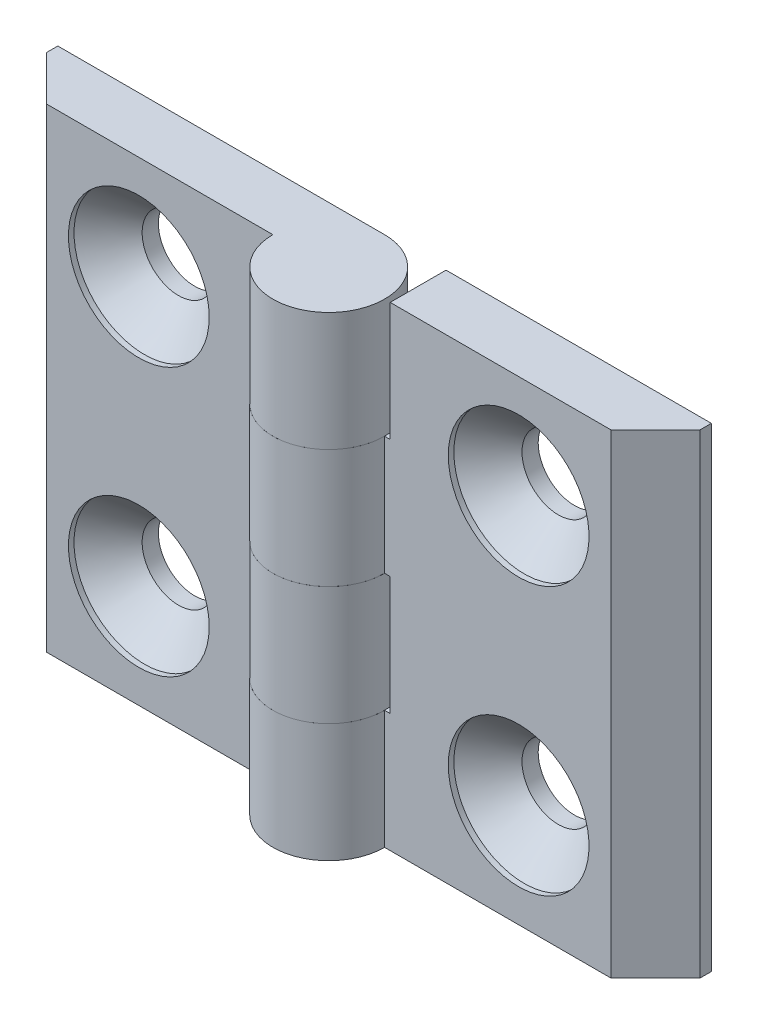
ISO-10303-21;
HEADER;
FILE_DESCRIPTION(('STEP AP214'),'2;1');
FILE_NAME('part.step','',(''),(''),'','','');
FILE_SCHEMA(('AUTOMOTIVE_DESIGN { 1 0 10303 214 1 1 1 1 }'));
ENDSEC;
DATA;
#1=APPLICATION_CONTEXT('core data for automotive mechanical design processes');
#2=APPLICATION_PROTOCOL_DEFINITION('international standard','automotive_design',2000,#1);
#3=PRODUCT_CONTEXT('',#1,'mechanical');
#4=PRODUCT('Part','Part','',(#3));
#5=PRODUCT_RELATED_PRODUCT_CATEGORY('part','',(#4));
#6=PRODUCT_DEFINITION_FORMATION('','',#4);
#7=PRODUCT_DEFINITION_CONTEXT('part definition',#1,'design');
#8=PRODUCT_DEFINITION('design','',#6,#7);
#9=PRODUCT_DEFINITION_SHAPE('','',#8);
#10=(LENGTH_UNIT() NAMED_UNIT(*) SI_UNIT(.MILLI.,.METRE.));
#11=(NAMED_UNIT(*) PLANE_ANGLE_UNIT() SI_UNIT($,.RADIAN.));
#12=(NAMED_UNIT(*) SI_UNIT($,.STERADIAN.) SOLID_ANGLE_UNIT());
#13=UNCERTAINTY_MEASURE_WITH_UNIT(LENGTH_MEASURE(1.E-05),#10,'distance_accuracy_value','');
#14=(GEOMETRIC_REPRESENTATION_CONTEXT(3) GLOBAL_UNCERTAINTY_ASSIGNED_CONTEXT((#13)) GLOBAL_UNIT_ASSIGNED_CONTEXT((#10,
#11,#12)) REPRESENTATION_CONTEXT('',''));
#15=CARTESIAN_POINT('',(0.,0.,0.));
#16=DIRECTION('',(0.,0.,1.));
#17=DIRECTION('',(1.,0.,0.));
#18=AXIS2_PLACEMENT_3D('',#15,#16,#17);
#19=CARTESIAN_POINT('',(0.,-21.25,0.));
#20=DIRECTION('',(0.,1.,0.));
#21=DIRECTION('',(0.,0.,-1.));
#22=AXIS2_PLACEMENT_3D('',#19,#20,#21);
#23=CYLINDRICAL_SURFACE('',#22,5.);
#24=DIRECTION('',(0.,1.,0.));
#25=VECTOR('',#24,1.);
#26=CARTESIAN_POINT('',(5.,-21.25,0.));
#27=LINE('',#26,#25);
#28=CARTESIAN_POINT('',(5.,-21.25,0.));
#29=VERTEX_POINT('',#28);
#30=CARTESIAN_POINT('',(5.,-10.625,0.));
#31=VERTEX_POINT('',#30);
#32=EDGE_CURVE('E194',#29,#31,#27,.T.);
#33=ORIENTED_EDGE('',*,*,#32,.T.);
#34=CARTESIAN_POINT('',(0.,-10.625,0.));
#35=DIRECTION('',(0.,-1.,0.));
#36=DIRECTION('',(0.,0.,1.));
#37=AXIS2_PLACEMENT_3D('',#34,#35,#36);
#38=CIRCLE('',#37,5.);
#39=CARTESIAN_POINT('',(0.,-10.625,-5.));
#40=VERTEX_POINT('',#39);
#41=EDGE_CURVE('E171',#31,#40,#38,.T.);
#42=ORIENTED_EDGE('',*,*,#41,.T.);
#43=DIRECTION('',(0.,1.,0.));
#44=VECTOR('',#43,1.);
#45=CARTESIAN_POINT('',(0.,-21.25,-5.));
#46=LINE('',#45,#44);
#47=CARTESIAN_POINT('',(0.,-21.25,-5.));
#48=VERTEX_POINT('',#47);
#49=EDGE_CURVE('E207',#48,#40,#46,.T.);
#50=ORIENTED_EDGE('',*,*,#49,.F.);
#51=CARTESIAN_POINT('',(0.,-21.25,0.));
#52=DIRECTION('',(0.,-1.,0.));
#53=DIRECTION('',(0.,0.,1.));
#54=AXIS2_PLACEMENT_3D('',#51,#52,#53);
#55=CIRCLE('',#54,5.);
#56=EDGE_CURVE('E174',#29,#48,#55,.T.);
#57=ORIENTED_EDGE('',*,*,#56,.F.);
#58=EDGE_LOOP('',(#33,#42,#50,#57));
#59=FACE_BOUND('',#58,.T.);
#60=ADVANCED_FACE('F45',(#59),#23,.T.);
#61=CARTESIAN_POINT('',(0.,0.,-5.));
#62=VERTEX_POINT('',#61);
#63=CARTESIAN_POINT('',(0.,10.625,-5.));
#64=VERTEX_POINT('',#63);
#65=EDGE_CURVE('E206',#62,#64,#46,.T.);
#66=ORIENTED_EDGE('',*,*,#65,.F.);
#67=CARTESIAN_POINT('',(0.,0.,0.));
#68=DIRECTION('',(0.,1.,0.));
#69=DIRECTION('',(0.,0.,-1.));
#70=AXIS2_PLACEMENT_3D('',#67,#68,#69);
#71=CIRCLE('',#70,5.);
#72=CARTESIAN_POINT('',(5.,0.,0.));
#73=VERTEX_POINT('',#72);
#74=EDGE_CURVE('E142',#62,#73,#71,.T.);
#75=ORIENTED_EDGE('',*,*,#74,.T.);
#76=CARTESIAN_POINT('',(5.,10.625,0.));
#77=VERTEX_POINT('',#76);
#78=EDGE_CURVE('E186',#73,#77,#27,.T.);
#79=ORIENTED_EDGE('',*,*,#78,.T.);
#80=CARTESIAN_POINT('',(0.,10.625,0.));
#81=DIRECTION('',(0.,-1.,0.));
#82=DIRECTION('',(1.,0.,0.));
#83=AXIS2_PLACEMENT_3D('',#80,#81,#82);
#84=CIRCLE('',#83,5.);
#85=EDGE_CURVE('E168',#77,#64,#84,.T.);
#86=ORIENTED_EDGE('',*,*,#85,.T.);
#87=EDGE_LOOP('',(#66,#75,#79,#86));
#88=FACE_BOUND('',#87,.T.);
#89=ADVANCED_FACE('F47',(#88),#23,.T.);
#90=CARTESIAN_POINT('',(0.,-21.25,-5.));
#91=DIRECTION('',(0.,0.,1.));
#92=DIRECTION('',(-1.,0.,0.));
#93=AXIS2_PLACEMENT_3D('',#90,#91,#92);
#94=PLANE('',#93);
#95=CARTESIAN_POINT('',(17.,-12.,-5.00000000000013));
#96=DIRECTION('',(0.,0.,1.));
#97=DIRECTION('',(-1.,0.,0.));
#98=AXIS2_PLACEMENT_3D('',#95,#96,#97);
#99=CIRCLE('',#98,3.25);
#100=CARTESIAN_POINT('',(13.75,-12.,-5.0000000000001));
#101=VERTEX_POINT('',#100);
#102=EDGE_CURVE('E377',#101,#101,#99,.T.);
#103=ORIENTED_EDGE('',*,*,#102,.T.);
#104=EDGE_LOOP('',(#103));
#105=FACE_BOUND('',#104,.T.);
#106=CARTESIAN_POINT('',(17.,12.,-5.00000000000013));
#107=DIRECTION('',(0.,0.,1.));
#108=DIRECTION('',(-1.,0.,0.));
#109=AXIS2_PLACEMENT_3D('',#106,#107,#108);
#110=CIRCLE('',#109,3.25);
#111=CARTESIAN_POINT('',(13.75,12.,-5.0000000000001));
#112=VERTEX_POINT('',#111);
#113=EDGE_CURVE('E155',#112,#112,#110,.T.);
#114=ORIENTED_EDGE('',*,*,#113,.T.);
#115=EDGE_LOOP('',(#114));
#116=FACE_BOUND('',#115,.T.);
#117=ORIENTED_EDGE('',*,*,#49,.T.);
#118=DIRECTION('',(1.,0.,0.));
#119=VECTOR('',#118,1.);
#120=CARTESIAN_POINT('',(5.49999999999996,-10.625,-5.00000000000004));
#121=LINE('',#120,#119);
#122=CARTESIAN_POINT('',(5.49999999999996,-10.625,-5.00000000000004));
#123=VERTEX_POINT('',#122);
#124=EDGE_CURVE('E137',#40,#123,#121,.T.);
#125=ORIENTED_EDGE('',*,*,#124,.T.);
#126=DIRECTION('',(0.,1.,0.));
#127=VECTOR('',#126,1.);
#128=CARTESIAN_POINT('',(5.49999999999996,-10.625,-5.00000000000004));
#129=LINE('',#128,#127);
#130=CARTESIAN_POINT('',(5.49999999999996,0.,-5.00000000000004));
#131=VERTEX_POINT('',#130);
#132=EDGE_CURVE('E132',#123,#131,#129,.T.);
#133=ORIENTED_EDGE('',*,*,#132,.T.);
#134=DIRECTION('',(-1.,0.,0.));
#135=VECTOR('',#134,1.);
#136=CARTESIAN_POINT('',(5.49999999999996,0.,-5.00000000000004));
#137=LINE('',#136,#135);
#138=EDGE_CURVE('E140',#131,#62,#137,.T.);
#139=ORIENTED_EDGE('',*,*,#138,.T.);
#140=ORIENTED_EDGE('',*,*,#65,.T.);
#141=DIRECTION('',(1.,0.,0.));
#142=VECTOR('',#141,1.);
#143=CARTESIAN_POINT('',(-5.00000000000004,10.625,-4.99999999999996));
#144=LINE('',#143,#142);
#145=CARTESIAN_POINT('',(5.49999999999996,10.625,-5.00000000000004));
#146=VERTEX_POINT('',#145);
#147=EDGE_CURVE('E160',#64,#146,#144,.T.);
#148=ORIENTED_EDGE('',*,*,#147,.T.);
#149=DIRECTION('',(0.,1.,0.));
#150=VECTOR('',#149,1.);
#151=CARTESIAN_POINT('',(5.49999999999996,21.25,-5.00000000000004));
#152=LINE('',#151,#150);
#153=CARTESIAN_POINT('',(5.49999999999996,21.25,-5.00000000000004));
#154=VERTEX_POINT('',#153);
#155=EDGE_CURVE('E163',#146,#154,#152,.T.);
#156=ORIENTED_EDGE('',*,*,#155,.T.);
#157=DIRECTION('',(1.,0.,0.));
#158=VECTOR('',#157,1.);
#159=CARTESIAN_POINT('',(0.,21.25,-5.));
#160=LINE('',#159,#158);
#161=CARTESIAN_POINT('',(29.25,21.25,-5.00000000000021));
#162=VERTEX_POINT('',#161);
#163=EDGE_CURVE('E173',#154,#162,#160,.T.);
#164=ORIENTED_EDGE('',*,*,#163,.T.);
#165=DIRECTION('',(0.,1.,0.));
#166=VECTOR('',#165,1.);
#167=CARTESIAN_POINT('',(29.25,-21.25,-5.00000000000021));
#168=LINE('',#167,#166);
#169=CARTESIAN_POINT('',(29.25,-21.25,-5.00000000000021));
#170=VERTEX_POINT('',#169);
#171=EDGE_CURVE('E203',#170,#162,#168,.T.);
#172=ORIENTED_EDGE('',*,*,#171,.F.);
#173=DIRECTION('',(1.,0.,0.));
#174=VECTOR('',#173,1.);
#175=CARTESIAN_POINT('',(0.,-21.25,-5.));
#176=LINE('',#175,#174);
#177=EDGE_CURVE('E177',#48,#170,#176,.T.);
#178=ORIENTED_EDGE('',*,*,#177,.F.);
#179=EDGE_LOOP('',(#117,#125,#133,#139,#140,#148,#156,#164,#172,#178));
#180=FACE_BOUND('',#179,.T.);
#181=ADVANCED_FACE('F148',(#105,#116,#180),#94,.F.);
#182=CARTESIAN_POINT('',(29.25,-21.25,-5.00000000000021));
#183=DIRECTION('',(-1.,0.,0.));
#184=DIRECTION('',(0.,0.,-1.));
#185=AXIS2_PLACEMENT_3D('',#182,#183,#184);
#186=PLANE('',#185);
#187=DIRECTION('',(0.,0.,1.));
#188=VECTOR('',#187,1.);
#189=CARTESIAN_POINT('',(29.25,21.25,-5.00000000000021));
#190=LINE('',#189,#188);
#191=CARTESIAN_POINT('',(29.25,21.25,-4.00000000000021));
#192=VERTEX_POINT('',#191);
#193=EDGE_CURVE('E188',#162,#192,#190,.T.);
#194=ORIENTED_EDGE('',*,*,#193,.T.);
#195=DIRECTION('',(0.,1.,0.));
#196=VECTOR('',#195,1.);
#197=CARTESIAN_POINT('',(29.25,-21.25,-4.00000000000021));
#198=LINE('',#197,#196);
#199=CARTESIAN_POINT('',(29.25,-21.25,-4.00000000000021));
#200=VERTEX_POINT('',#199);
#201=EDGE_CURVE('E200',#200,#192,#198,.T.);
#202=ORIENTED_EDGE('',*,*,#201,.F.);
#203=DIRECTION('',(0.,0.,1.));
#204=VECTOR('',#203,1.);
#205=CARTESIAN_POINT('',(29.25,-21.25,-5.00000000000021));
#206=LINE('',#205,#204);
#207=EDGE_CURVE('E180',#170,#200,#206,.T.);
#208=ORIENTED_EDGE('',*,*,#207,.F.);
#209=ORIENTED_EDGE('',*,*,#171,.T.);
#210=EDGE_LOOP('',(#194,#202,#208,#209));
#211=FACE_BOUND('',#210,.T.);
#212=ADVANCED_FACE('F237',(#211),#186,.F.);
#213=CARTESIAN_POINT('',(29.25,-21.25,-4.00000000000021));
#214=DIRECTION('',(-0.707106781186549,0.,-0.707106781186546));
#215=DIRECTION('',(0.707106781186546,0.,-0.707106781186549));
#216=AXIS2_PLACEMENT_3D('',#213,#214,#215);
#217=PLANE('',#216);
#218=DIRECTION('',(-0.707106781186546,0.,0.707106781186549));
#219=VECTOR('',#218,1.);
#220=CARTESIAN_POINT('',(29.25,21.25,-4.00000000000021));
#221=LINE('',#220,#219);
#222=CARTESIAN_POINT('',(25.25,21.25,-1.88688740282966E-13));
#223=VERTEX_POINT('',#222);
#224=EDGE_CURVE('E190',#192,#223,#221,.T.);
#225=ORIENTED_EDGE('',*,*,#224,.T.);
#226=DIRECTION('',(0.,1.,0.));
#227=VECTOR('',#226,1.);
#228=CARTESIAN_POINT('',(25.25,-21.25,-1.88688740282966E-13));
#229=LINE('',#228,#227);
#230=CARTESIAN_POINT('',(25.25,-21.25,-1.88688740282966E-13));
#231=VERTEX_POINT('',#230);
#232=EDGE_CURVE('E197',#231,#223,#229,.T.);
#233=ORIENTED_EDGE('',*,*,#232,.F.);
#234=DIRECTION('',(-0.707106781186546,0.,0.707106781186549));
#235=VECTOR('',#234,1.);
#236=CARTESIAN_POINT('',(29.25,-21.25,-4.00000000000021));
#237=LINE('',#236,#235);
#238=EDGE_CURVE('E182',#200,#231,#237,.T.);
#239=ORIENTED_EDGE('',*,*,#238,.F.);
#240=ORIENTED_EDGE('',*,*,#201,.T.);
#241=EDGE_LOOP('',(#225,#233,#239,#240));
#242=FACE_BOUND('',#241,.T.);
#243=ADVANCED_FACE('F234',(#242),#217,.F.);
#244=CARTESIAN_POINT('',(25.25,-21.25,-1.88688740282966E-13));
#245=DIRECTION('',(0.,0.,-1.));
#246=DIRECTION('',(1.,0.,0.));
#247=AXIS2_PLACEMENT_3D('',#244,#245,#246);
#248=PLANE('',#247);
#249=CARTESIAN_POINT('',(17.,-12.,-1.27254804189366E-13));
#250=DIRECTION('',(0.,0.,1.));
#251=DIRECTION('',(-1.,0.,0.));
#252=AXIS2_PLACEMENT_3D('',#249,#250,#251);
#253=CIRCLE('',#252,6.3);
#254=CARTESIAN_POINT('',(10.7,-12.,0.));
#255=VERTEX_POINT('',#254);
#256=EDGE_CURVE('E370',#255,#255,#253,.T.);
#257=ORIENTED_EDGE('',*,*,#256,.F.);
#258=EDGE_LOOP('',(#257));
#259=FACE_BOUND('',#258,.T.);
#260=CARTESIAN_POINT('',(17.,12.,-1.27254804189366E-13));
#261=DIRECTION('',(0.,0.,1.));
#262=DIRECTION('',(-1.,0.,0.));
#263=AXIS2_PLACEMENT_3D('',#260,#261,#262);
#264=CIRCLE('',#263,6.3);
#265=CARTESIAN_POINT('',(10.7,12.,0.));
#266=VERTEX_POINT('',#265);
#267=EDGE_CURVE('E379',#266,#266,#264,.T.);
#268=ORIENTED_EDGE('',*,*,#267,.F.);
#269=EDGE_LOOP('',(#268));
#270=FACE_BOUND('',#269,.T.);
#271=DIRECTION('',(0.,-1.,0.));
#272=VECTOR('',#271,1.);
#273=CARTESIAN_POINT('',(5.5,-21.25,0.));
#274=LINE('',#273,#272);
#275=CARTESIAN_POINT('',(5.5,0.,0.));
#276=VERTEX_POINT('',#275);
#277=CARTESIAN_POINT('',(5.5,-10.625,0.));
#278=VERTEX_POINT('',#277);
#279=EDGE_CURVE('E53',#276,#278,#274,.T.);
#280=ORIENTED_EDGE('',*,*,#279,.T.);
#281=DIRECTION('',(-1.,0.,0.));
#282=VECTOR('',#281,1.);
#283=CARTESIAN_POINT('',(25.25,-10.625,-1.88688740282966E-13));
#284=LINE('',#283,#282);
#285=EDGE_CURVE('E12',#278,#31,#284,.T.);
#286=ORIENTED_EDGE('',*,*,#285,.T.);
#287=ORIENTED_EDGE('',*,*,#32,.F.);
#288=DIRECTION('',(-1.,0.,0.));
#289=VECTOR('',#288,1.);
#290=CARTESIAN_POINT('',(25.25,-21.25,-1.88688740282966E-13));
#291=LINE('',#290,#289);
#292=EDGE_CURVE('E184',#231,#29,#291,.T.);
#293=ORIENTED_EDGE('',*,*,#292,.F.);
#294=ORIENTED_EDGE('',*,*,#232,.T.);
#295=DIRECTION('',(-1.,0.,0.));
#296=VECTOR('',#295,1.);
#297=CARTESIAN_POINT('',(25.25,21.25,-1.88688740282966E-13));
#298=LINE('',#297,#296);
#299=CARTESIAN_POINT('',(5.5,21.25,0.));
#300=VERTEX_POINT('',#299);
#301=EDGE_CURVE('E178',#223,#300,#298,.T.);
#302=ORIENTED_EDGE('',*,*,#301,.T.);
#303=DIRECTION('',(0.,-1.,0.));
#304=VECTOR('',#303,1.);
#305=CARTESIAN_POINT('',(5.49999999999998,-21.25,0.));
#306=LINE('',#305,#304);
#307=CARTESIAN_POINT('',(5.5,10.625,0.));
#308=VERTEX_POINT('',#307);
#309=EDGE_CURVE('E68',#300,#308,#306,.T.);
#310=ORIENTED_EDGE('',*,*,#309,.T.);
#311=DIRECTION('',(-1.,0.,0.));
#312=VECTOR('',#311,1.);
#313=CARTESIAN_POINT('',(25.25,10.625,-1.88688740282966E-13));
#314=LINE('',#313,#312);
#315=EDGE_CURVE('E209',#308,#77,#314,.T.);
#316=ORIENTED_EDGE('',*,*,#315,.T.);
#317=ORIENTED_EDGE('',*,*,#78,.F.);
#318=DIRECTION('',(1.,0.,0.));
#319=VECTOR('',#318,1.);
#320=CARTESIAN_POINT('',(25.25,0.,-1.88688740282966E-13));
#321=LINE('',#320,#319);
#322=EDGE_CURVE('E212',#73,#276,#321,.T.);
#323=ORIENTED_EDGE('',*,*,#322,.T.);
#324=EDGE_LOOP('',(#280,#286,#287,#293,#294,#302,#310,#316,#317,#323));
#325=FACE_BOUND('',#324,.T.);
#326=ADVANCED_FACE('F214',(#259,#270,#325),#248,.F.);
#327=CARTESIAN_POINT('',(0.,-21.25,0.));
#328=DIRECTION('',(0.,-1.,0.));
#329=DIRECTION('',(0.,0.,1.));
#330=AXIS2_PLACEMENT_3D('',#327,#328,#329);
#331=PLANE('',#330);
#332=ORIENTED_EDGE('',*,*,#56,.T.);
#333=ORIENTED_EDGE('',*,*,#177,.T.);
#334=ORIENTED_EDGE('',*,*,#207,.T.);
#335=ORIENTED_EDGE('',*,*,#238,.T.);
#336=ORIENTED_EDGE('',*,*,#292,.T.);
#337=EDGE_LOOP('',(#332,#333,#334,#335,#336));
#338=FACE_BOUND('',#337,.T.);
#339=ADVANCED_FACE('F243',(#338),#331,.T.);
#340=CARTESIAN_POINT('',(0.,21.25,0.));
#341=DIRECTION('',(0.,-1.,0.));
#342=DIRECTION('',(0.,0.,1.));
#343=AXIS2_PLACEMENT_3D('',#340,#341,#342);
#344=PLANE('',#343);
#345=ORIENTED_EDGE('',*,*,#163,.F.);
#346=DIRECTION('',(0.,0.,1.));
#347=VECTOR('',#346,1.);
#348=CARTESIAN_POINT('',(5.49999999999996,21.25,-5.00000000000004));
#349=LINE('',#348,#347);
#350=EDGE_CURVE('E150',#154,#300,#349,.T.);
#351=ORIENTED_EDGE('',*,*,#350,.T.);
#352=ORIENTED_EDGE('',*,*,#301,.F.);
#353=ORIENTED_EDGE('',*,*,#224,.F.);
#354=ORIENTED_EDGE('',*,*,#193,.F.);
#355=EDGE_LOOP('',(#345,#351,#352,#353,#354));
#356=FACE_BOUND('',#355,.T.);
#357=ADVANCED_FACE('F227',(#356),#344,.F.);
#358=CARTESIAN_POINT('',(-5.00000000000004,10.625,-4.99999999999996));
#359=DIRECTION('',(0.,-1.,0.));
#360=DIRECTION('',(1.,0.,0.));
#361=AXIS2_PLACEMENT_3D('',#358,#359,#360);
#362=PLANE('',#361);
#363=ORIENTED_EDGE('',*,*,#85,.F.);
#364=ORIENTED_EDGE('',*,*,#315,.F.);
#365=DIRECTION('',(0.,0.,1.));
#366=VECTOR('',#365,1.);
#367=CARTESIAN_POINT('',(5.49999999999996,10.625,-5.00000000000004));
#368=LINE('',#367,#366);
#369=EDGE_CURVE('E152',#146,#308,#368,.T.);
#370=ORIENTED_EDGE('',*,*,#369,.F.);
#371=ORIENTED_EDGE('',*,*,#147,.F.);
#372=EDGE_LOOP('',(#363,#364,#370,#371));
#373=FACE_BOUND('',#372,.T.);
#374=ADVANCED_FACE('F223',(#373),#362,.F.);
#375=CARTESIAN_POINT('',(5.49999999999996,21.25,-5.00000000000004));
#376=DIRECTION('',(1.,0.,0.));
#377=DIRECTION('',(0.,1.,0.));
#378=AXIS2_PLACEMENT_3D('',#375,#376,#377);
#379=PLANE('',#378);
#380=ORIENTED_EDGE('',*,*,#350,.F.);
#381=ORIENTED_EDGE('',*,*,#155,.F.);
#382=ORIENTED_EDGE('',*,*,#369,.T.);
#383=ORIENTED_EDGE('',*,*,#309,.F.);
#384=EDGE_LOOP('',(#380,#381,#382,#383));
#385=FACE_BOUND('',#384,.T.);
#386=ADVANCED_FACE('F224',(#385),#379,.F.);
#387=CARTESIAN_POINT('',(5.49999999999996,-10.625,-5.00000000000004));
#388=DIRECTION('',(1.,0.,0.));
#389=DIRECTION('',(0.,1.,0.));
#390=AXIS2_PLACEMENT_3D('',#387,#388,#389);
#391=PLANE('',#390);
#392=DIRECTION('',(0.,0.,1.));
#393=VECTOR('',#392,1.);
#394=CARTESIAN_POINT('',(5.49999999999996,0.,-5.00000000000004));
#395=LINE('',#394,#393);
#396=EDGE_CURVE('E60',#131,#276,#395,.T.);
#397=ORIENTED_EDGE('',*,*,#396,.F.);
#398=ORIENTED_EDGE('',*,*,#132,.F.);
#399=DIRECTION('',(0.,0.,1.));
#400=VECTOR('',#399,1.);
#401=CARTESIAN_POINT('',(5.49999999999996,-10.625,-5.00000000000004));
#402=LINE('',#401,#400);
#403=EDGE_CURVE('E136',#123,#278,#402,.T.);
#404=ORIENTED_EDGE('',*,*,#403,.T.);
#405=ORIENTED_EDGE('',*,*,#279,.F.);
#406=EDGE_LOOP('',(#397,#398,#404,#405));
#407=FACE_BOUND('',#406,.T.);
#408=ADVANCED_FACE('F129',(#407),#391,.F.);
#409=CARTESIAN_POINT('',(5.49999999999996,-10.625,-5.00000000000004));
#410=DIRECTION('',(0.,-1.,0.));
#411=DIRECTION('',(0.,0.,1.));
#412=AXIS2_PLACEMENT_3D('',#409,#410,#411);
#413=PLANE('',#412);
#414=ORIENTED_EDGE('',*,*,#41,.F.);
#415=ORIENTED_EDGE('',*,*,#285,.F.);
#416=ORIENTED_EDGE('',*,*,#403,.F.);
#417=ORIENTED_EDGE('',*,*,#124,.F.);
#418=EDGE_LOOP('',(#414,#415,#416,#417));
#419=FACE_BOUND('',#418,.T.);
#420=ADVANCED_FACE('F246',(#419),#413,.F.);
#421=CARTESIAN_POINT('',(5.49999999999996,0.,-5.00000000000004));
#422=DIRECTION('',(0.,1.,0.));
#423=DIRECTION('',(0.,0.,-1.));
#424=AXIS2_PLACEMENT_3D('',#421,#422,#423);
#425=PLANE('',#424);
#426=ORIENTED_EDGE('',*,*,#138,.F.);
#427=ORIENTED_EDGE('',*,*,#396,.T.);
#428=ORIENTED_EDGE('',*,*,#322,.F.);
#429=ORIENTED_EDGE('',*,*,#74,.F.);
#430=EDGE_LOOP('',(#426,#427,#428,#429));
#431=FACE_BOUND('',#430,.T.);
#432=ADVANCED_FACE('F141',(#431),#425,.F.);
#433=CARTESIAN_POINT('',(17.,12.,-1.27037963754869E-13));
#434=DIRECTION('',(0.,0.,1.));
#435=DIRECTION('',(-1.,0.,0.));
#436=AXIS2_PLACEMENT_3D('',#433,#434,#435);
#437=CYLINDRICAL_SURFACE('',#436,3.25);
#438=ORIENTED_EDGE('',*,*,#113,.F.);
#439=EDGE_LOOP('',(#438));
#440=FACE_BOUND('',#439,.T.);
#441=CARTESIAN_POINT('',(17.,12.,-3.55000000000013));
#442=DIRECTION('',(0.,0.,1.));
#443=DIRECTION('',(-1.,0.,0.));
#444=AXIS2_PLACEMENT_3D('',#441,#442,#443);
#445=CIRCLE('',#444,3.25);
#446=CARTESIAN_POINT('',(13.75,12.,-3.5500000000001));
#447=VERTEX_POINT('',#446);
#448=EDGE_CURVE('E384',#447,#447,#445,.T.);
#449=ORIENTED_EDGE('',*,*,#448,.T.);
#450=EDGE_LOOP('',(#449));
#451=FACE_BOUND('',#450,.T.);
#452=ADVANCED_FACE('F253',(#440,#451),#437,.F.);
#453=CARTESIAN_POINT('',(17.,12.,-0.500000000000127));
#454=DIRECTION('',(0.,0.,1.));
#455=DIRECTION('',(-1.,0.,0.));
#456=AXIS2_PLACEMENT_3D('',#453,#454,#455);
#457=CONICAL_SURFACE('',#456,6.3,0.785398163397449);
#458=ORIENTED_EDGE('',*,*,#448,.F.);
#459=EDGE_LOOP('',(#458));
#460=FACE_BOUND('',#459,.T.);
#461=CARTESIAN_POINT('',(17.,12.,-0.500000000000127));
#462=DIRECTION('',(0.,0.,1.));
#463=DIRECTION('',(-1.,0.,0.));
#464=AXIS2_PLACEMENT_3D('',#461,#462,#463);
#465=CIRCLE('',#464,6.3);
#466=CARTESIAN_POINT('',(10.7,12.,-0.50000000000008));
#467=VERTEX_POINT('',#466);
#468=EDGE_CURVE('E382',#467,#467,#465,.T.);
#469=ORIENTED_EDGE('',*,*,#468,.T.);
#470=EDGE_LOOP('',(#469));
#471=FACE_BOUND('',#470,.T.);
#472=ADVANCED_FACE('F311',(#460,#471),#457,.F.);
#473=CARTESIAN_POINT('',(17.,12.,-1.27037963754869E-13));
#474=DIRECTION('',(0.,0.,1.));
#475=DIRECTION('',(-1.,0.,0.));
#476=AXIS2_PLACEMENT_3D('',#473,#474,#475);
#477=CYLINDRICAL_SURFACE('',#476,6.3);
#478=ORIENTED_EDGE('',*,*,#468,.F.);
#479=EDGE_LOOP('',(#478));
#480=FACE_BOUND('',#479,.T.);
#481=ORIENTED_EDGE('',*,*,#267,.T.);
#482=EDGE_LOOP('',(#481));
#483=FACE_BOUND('',#482,.T.);
#484=ADVANCED_FACE('F320',(#480,#483),#477,.F.);
#485=CARTESIAN_POINT('',(17.,-12.,-1.27037963754869E-13));
#486=DIRECTION('',(0.,0.,1.));
#487=DIRECTION('',(-1.,0.,0.));
#488=AXIS2_PLACEMENT_3D('',#485,#486,#487);
#489=CYLINDRICAL_SURFACE('',#488,3.25);
#490=ORIENTED_EDGE('',*,*,#102,.F.);
#491=EDGE_LOOP('',(#490));
#492=FACE_BOUND('',#491,.T.);
#493=CARTESIAN_POINT('',(17.,-12.,-3.55000000000013));
#494=DIRECTION('',(0.,0.,1.));
#495=DIRECTION('',(-1.,0.,0.));
#496=AXIS2_PLACEMENT_3D('',#493,#494,#495);
#497=CIRCLE('',#496,3.25);
#498=CARTESIAN_POINT('',(13.75,-12.,-3.5500000000001));
#499=VERTEX_POINT('',#498);
#500=EDGE_CURVE('E372',#499,#499,#497,.T.);
#501=ORIENTED_EDGE('',*,*,#500,.T.);
#502=EDGE_LOOP('',(#501));
#503=FACE_BOUND('',#502,.T.);
#504=ADVANCED_FACE('F330',(#492,#503),#489,.F.);
#505=CARTESIAN_POINT('',(17.,-12.,-0.500000000000127));
#506=DIRECTION('',(0.,0.,1.));
#507=DIRECTION('',(-1.,0.,0.));
#508=AXIS2_PLACEMENT_3D('',#505,#506,#507);
#509=CONICAL_SURFACE('',#508,6.3,0.785398163397449);
#510=ORIENTED_EDGE('',*,*,#500,.F.);
#511=EDGE_LOOP('',(#510));
#512=FACE_BOUND('',#511,.T.);
#513=CARTESIAN_POINT('',(17.,-12.,-0.500000000000127));
#514=DIRECTION('',(0.,0.,1.));
#515=DIRECTION('',(-1.,0.,0.));
#516=AXIS2_PLACEMENT_3D('',#513,#514,#515);
#517=CIRCLE('',#516,6.3);
#518=CARTESIAN_POINT('',(10.7,-12.,-0.50000000000008));
#519=VERTEX_POINT('',#518);
#520=EDGE_CURVE('E367',#519,#519,#517,.T.);
#521=ORIENTED_EDGE('',*,*,#520,.T.);
#522=EDGE_LOOP('',(#521));
#523=FACE_BOUND('',#522,.T.);
#524=ADVANCED_FACE('F340',(#512,#523),#509,.F.);
#525=CARTESIAN_POINT('',(17.,-12.,-1.27037963754869E-13));
#526=DIRECTION('',(0.,0.,1.));
#527=DIRECTION('',(-1.,0.,0.));
#528=AXIS2_PLACEMENT_3D('',#525,#526,#527);
#529=CYLINDRICAL_SURFACE('',#528,6.3);
#530=ORIENTED_EDGE('',*,*,#520,.F.);
#531=EDGE_LOOP('',(#530));
#532=FACE_BOUND('',#531,.T.);
#533=ORIENTED_EDGE('',*,*,#256,.T.);
#534=EDGE_LOOP('',(#533));
#535=FACE_BOUND('',#534,.T.);
#536=ADVANCED_FACE('F350',(#532,#535),#529,.F.);
#537=CLOSED_SHELL('',(#60,#89,#181,#212,#243,#326,#339,#357,#374,#386,#408,#420,#432,#452,#472,
#484,#504,#524,#536));
#538=MANIFOLD_SOLID_BREP('B2',#537);
#539=CARTESIAN_POINT('',(0.,21.25,0.));
#540=DIRECTION('',(0.,-1.,0.));
#541=DIRECTION('',(0.,0.,-1.));
#542=AXIS2_PLACEMENT_3D('',#539,#540,#541);
#543=CYLINDRICAL_SURFACE('',#542,5.);
#544=DIRECTION('',(0.,-1.,0.));
#545=VECTOR('',#544,1.);
#546=CARTESIAN_POINT('',(-5.,21.25,0.));
#547=LINE('',#546,#545);
#548=CARTESIAN_POINT('',(-5.,21.25,0.));
#549=VERTEX_POINT('',#548);
#550=CARTESIAN_POINT('',(-5.,10.625,0.));
#551=VERTEX_POINT('',#550);
#552=EDGE_CURVE('E599',#549,#551,#547,.T.);
#553=ORIENTED_EDGE('',*,*,#552,.T.);
#554=CARTESIAN_POINT('',(0.,10.625,0.));
#555=DIRECTION('',(0.,1.,0.));
#556=DIRECTION('',(0.,0.,1.));
#557=AXIS2_PLACEMENT_3D('',#554,#555,#556);
#558=CIRCLE('',#557,5.);
#559=CARTESIAN_POINT('',(0.,10.625,-5.));
#560=VERTEX_POINT('',#559);
#561=EDGE_CURVE('E576',#551,#560,#558,.T.);
#562=ORIENTED_EDGE('',*,*,#561,.T.);
#563=DIRECTION('',(0.,-1.,0.));
#564=VECTOR('',#563,1.);
#565=CARTESIAN_POINT('',(0.,21.25,-5.));
#566=LINE('',#565,#564);
#567=CARTESIAN_POINT('',(0.,21.25,-5.));
#568=VERTEX_POINT('',#567);
#569=EDGE_CURVE('E612',#568,#560,#566,.T.);
#570=ORIENTED_EDGE('',*,*,#569,.F.);
#571=CARTESIAN_POINT('',(0.,21.25,0.));
#572=DIRECTION('',(0.,1.,0.));
#573=DIRECTION('',(0.,0.,1.));
#574=AXIS2_PLACEMENT_3D('',#571,#572,#573);
#575=CIRCLE('',#574,5.);
#576=EDGE_CURVE('E579',#549,#568,#575,.T.);
#577=ORIENTED_EDGE('',*,*,#576,.F.);
#578=EDGE_LOOP('',(#553,#562,#570,#577));
#579=FACE_BOUND('',#578,.T.);
#580=ADVANCED_FACE('F450',(#579),#543,.T.);
#581=CARTESIAN_POINT('',(0.,0.,-5.));
#582=VERTEX_POINT('',#581);
#583=CARTESIAN_POINT('',(0.,-10.625,-5.));
#584=VERTEX_POINT('',#583);
#585=EDGE_CURVE('E611',#582,#584,#566,.T.);
#586=ORIENTED_EDGE('',*,*,#585,.F.);
#587=CARTESIAN_POINT('',(0.,0.,0.));
#588=DIRECTION('',(0.,-1.,0.));
#589=DIRECTION('',(0.,0.,-1.));
#590=AXIS2_PLACEMENT_3D('',#587,#588,#589);
#591=CIRCLE('',#590,5.);
#592=CARTESIAN_POINT('',(-5.,0.,0.));
#593=VERTEX_POINT('',#592);
#594=EDGE_CURVE('E547',#582,#593,#591,.T.);
#595=ORIENTED_EDGE('',*,*,#594,.T.);
#596=CARTESIAN_POINT('',(-5.,-10.625,0.));
#597=VERTEX_POINT('',#596);
#598=EDGE_CURVE('E591',#593,#597,#547,.T.);
#599=ORIENTED_EDGE('',*,*,#598,.T.);
#600=CARTESIAN_POINT('',(0.,-10.625,0.));
#601=DIRECTION('',(0.,1.,0.));
#602=DIRECTION('',(-1.,0.,0.));
#603=AXIS2_PLACEMENT_3D('',#600,#601,#602);
#604=CIRCLE('',#603,5.);
#605=EDGE_CURVE('E573',#597,#584,#604,.T.);
#606=ORIENTED_EDGE('',*,*,#605,.T.);
#607=EDGE_LOOP('',(#586,#595,#599,#606));
#608=FACE_BOUND('',#607,.T.);
#609=ADVANCED_FACE('F452',(#608),#543,.T.);
#610=CARTESIAN_POINT('',(0.,21.25,-5.));
#611=DIRECTION('',(0.,0.,1.));
#612=DIRECTION('',(1.,0.,0.));
#613=AXIS2_PLACEMENT_3D('',#610,#611,#612);
#614=PLANE('',#613);
#615=CARTESIAN_POINT('',(-17.,12.,-5.));
#616=DIRECTION('',(0.,0.,1.));
#617=DIRECTION('',(1.,0.,0.));
#618=AXIS2_PLACEMENT_3D('',#615,#616,#617);
#619=CIRCLE('',#618,3.25);
#620=CARTESIAN_POINT('',(-13.75,12.,-5.));
#621=VERTEX_POINT('',#620);
#622=EDGE_CURVE('E796',#621,#621,#619,.T.);
#623=ORIENTED_EDGE('',*,*,#622,.T.);
#624=EDGE_LOOP('',(#623));
#625=FACE_BOUND('',#624,.T.);
#626=CARTESIAN_POINT('',(-17.,-12.,-5.));
#627=DIRECTION('',(0.,0.,1.));
#628=DIRECTION('',(1.,0.,0.));
#629=AXIS2_PLACEMENT_3D('',#626,#627,#628);
#630=CIRCLE('',#629,3.25);
#631=CARTESIAN_POINT('',(-13.75,-12.,-5.));
#632=VERTEX_POINT('',#631);
#633=EDGE_CURVE('E560',#632,#632,#630,.T.);
#634=ORIENTED_EDGE('',*,*,#633,.T.);
#635=EDGE_LOOP('',(#634));
#636=FACE_BOUND('',#635,.T.);
#637=ORIENTED_EDGE('',*,*,#569,.T.);
#638=DIRECTION('',(-1.,0.,0.));
#639=VECTOR('',#638,1.);
#640=CARTESIAN_POINT('',(-5.5,10.625,-5.));
#641=LINE('',#640,#639);
#642=CARTESIAN_POINT('',(-5.5,10.625,-5.));
#643=VERTEX_POINT('',#642);
#644=EDGE_CURVE('E542',#560,#643,#641,.T.);
#645=ORIENTED_EDGE('',*,*,#644,.T.);
#646=DIRECTION('',(0.,-1.,0.));
#647=VECTOR('',#646,1.);
#648=CARTESIAN_POINT('',(-5.5,10.625,-5.));
#649=LINE('',#648,#647);
#650=CARTESIAN_POINT('',(-5.5,0.,-5.));
#651=VERTEX_POINT('',#650);
#652=EDGE_CURVE('E537',#643,#651,#649,.T.);
#653=ORIENTED_EDGE('',*,*,#652,.T.);
#654=DIRECTION('',(1.,0.,0.));
#655=VECTOR('',#654,1.);
#656=CARTESIAN_POINT('',(-5.5,0.,-5.));
#657=LINE('',#656,#655);
#658=EDGE_CURVE('E545',#651,#582,#657,.T.);
#659=ORIENTED_EDGE('',*,*,#658,.T.);
#660=ORIENTED_EDGE('',*,*,#585,.T.);
#661=DIRECTION('',(-1.,0.,0.));
#662=VECTOR('',#661,1.);
#663=CARTESIAN_POINT('',(5.,-10.625,-5.));
#664=LINE('',#663,#662);
#665=CARTESIAN_POINT('',(-5.5,-10.625,-5.));
#666=VERTEX_POINT('',#665);
#667=EDGE_CURVE('E565',#584,#666,#664,.T.);
#668=ORIENTED_EDGE('',*,*,#667,.T.);
#669=DIRECTION('',(0.,-1.,0.));
#670=VECTOR('',#669,1.);
#671=CARTESIAN_POINT('',(-5.5,-21.25,-5.));
#672=LINE('',#671,#670);
#673=CARTESIAN_POINT('',(-5.5,-21.25,-5.));
#674=VERTEX_POINT('',#673);
#675=EDGE_CURVE('E568',#666,#674,#672,.T.);
#676=ORIENTED_EDGE('',*,*,#675,.T.);
#677=DIRECTION('',(-1.,0.,0.));
#678=VECTOR('',#677,1.);
#679=CARTESIAN_POINT('',(0.,-21.25,-5.));
#680=LINE('',#679,#678);
#681=CARTESIAN_POINT('',(-29.25,-21.25,-5.));
#682=VERTEX_POINT('',#681);
#683=EDGE_CURVE('E578',#674,#682,#680,.T.);
#684=ORIENTED_EDGE('',*,*,#683,.T.);
#685=DIRECTION('',(0.,-1.,0.));
#686=VECTOR('',#685,1.);
#687=CARTESIAN_POINT('',(-29.25,21.25,-5.));
#688=LINE('',#687,#686);
#689=CARTESIAN_POINT('',(-29.25,21.25,-5.));
#690=VERTEX_POINT('',#689);
#691=EDGE_CURVE('E608',#690,#682,#688,.T.);
#692=ORIENTED_EDGE('',*,*,#691,.F.);
#693=DIRECTION('',(-1.,0.,0.));
#694=VECTOR('',#693,1.);
#695=CARTESIAN_POINT('',(0.,21.25,-5.));
#696=LINE('',#695,#694);
#697=EDGE_CURVE('E582',#568,#690,#696,.T.);
#698=ORIENTED_EDGE('',*,*,#697,.F.);
#699=EDGE_LOOP('',(#637,#645,#653,#659,#660,#668,#676,#684,#692,#698));
#700=FACE_BOUND('',#699,.T.);
#701=ADVANCED_FACE('F553',(#625,#636,#700),#614,.F.);
#702=CARTESIAN_POINT('',(-29.25,21.25,-5.));
#703=DIRECTION('',(1.,0.,0.));
#704=DIRECTION('',(0.,0.,-1.));
#705=AXIS2_PLACEMENT_3D('',#702,#703,#704);
#706=PLANE('',#705);
#707=DIRECTION('',(0.,0.,1.));
#708=VECTOR('',#707,1.);
#709=CARTESIAN_POINT('',(-29.25,-21.25,-5.));
#710=LINE('',#709,#708);
#711=CARTESIAN_POINT('',(-29.25,-21.25,-4.));
#712=VERTEX_POINT('',#711);
#713=EDGE_CURVE('E593',#682,#712,#710,.T.);
#714=ORIENTED_EDGE('',*,*,#713,.T.);
#715=DIRECTION('',(0.,-1.,0.));
#716=VECTOR('',#715,1.);
#717=CARTESIAN_POINT('',(-29.25,21.25,-4.));
#718=LINE('',#717,#716);
#719=CARTESIAN_POINT('',(-29.25,21.25,-4.));
#720=VERTEX_POINT('',#719);
#721=EDGE_CURVE('E605',#720,#712,#718,.T.);
#722=ORIENTED_EDGE('',*,*,#721,.F.);
#723=DIRECTION('',(0.,0.,1.));
#724=VECTOR('',#723,1.);
#725=CARTESIAN_POINT('',(-29.25,21.25,-5.));
#726=LINE('',#725,#724);
#727=EDGE_CURVE('E585',#690,#720,#726,.T.);
#728=ORIENTED_EDGE('',*,*,#727,.F.);
#729=ORIENTED_EDGE('',*,*,#691,.T.);
#730=EDGE_LOOP('',(#714,#722,#728,#729));
#731=FACE_BOUND('',#730,.T.);
#732=ADVANCED_FACE('F642',(#731),#706,.F.);
#733=CARTESIAN_POINT('',(-29.25,21.25,-4.));
#734=DIRECTION('',(0.707106781186543,0.,-0.707106781186551));
#735=DIRECTION('',(-0.707106781186552,0.,-0.707106781186544));
#736=AXIS2_PLACEMENT_3D('',#733,#734,#735);
#737=PLANE('',#736);
#738=DIRECTION('',(0.707106781186552,0.,0.707106781186544));
#739=VECTOR('',#738,1.);
#740=CARTESIAN_POINT('',(-29.25,-21.25,-4.));
#741=LINE('',#740,#739);
#742=CARTESIAN_POINT('',(-25.25,-21.25,0.));
#743=VERTEX_POINT('',#742);
#744=EDGE_CURVE('E595',#712,#743,#741,.T.);
#745=ORIENTED_EDGE('',*,*,#744,.T.);
#746=DIRECTION('',(0.,-1.,0.));
#747=VECTOR('',#746,1.);
#748=CARTESIAN_POINT('',(-25.25,21.25,0.));
#749=LINE('',#748,#747);
#750=CARTESIAN_POINT('',(-25.25,21.25,0.));
#751=VERTEX_POINT('',#750);
#752=EDGE_CURVE('E602',#751,#743,#749,.T.);
#753=ORIENTED_EDGE('',*,*,#752,.F.);
#754=DIRECTION('',(0.707106781186552,0.,0.707106781186544));
#755=VECTOR('',#754,1.);
#756=CARTESIAN_POINT('',(-29.25,21.25,-4.));
#757=LINE('',#756,#755);
#758=EDGE_CURVE('E587',#720,#751,#757,.T.);
#759=ORIENTED_EDGE('',*,*,#758,.F.);
#760=ORIENTED_EDGE('',*,*,#721,.T.);
#761=EDGE_LOOP('',(#745,#753,#759,#760));
#762=FACE_BOUND('',#761,.T.);
#763=ADVANCED_FACE('F639',(#762),#737,.F.);
#764=CARTESIAN_POINT('',(-25.25,21.25,0.));
#765=DIRECTION('',(0.,0.,-1.));
#766=DIRECTION('',(-1.,0.,0.));
#767=AXIS2_PLACEMENT_3D('',#764,#765,#766);
#768=PLANE('',#767);
#769=CARTESIAN_POINT('',(-17.,12.,0.));
#770=DIRECTION('',(0.,0.,1.));
#771=DIRECTION('',(1.,0.,0.));
#772=AXIS2_PLACEMENT_3D('',#769,#770,#771);
#773=CIRCLE('',#772,6.3);
#774=CARTESIAN_POINT('',(-10.7,12.,0.));
#775=VERTEX_POINT('',#774);
#776=EDGE_CURVE('E789',#775,#775,#773,.T.);
#777=ORIENTED_EDGE('',*,*,#776,.F.);
#778=EDGE_LOOP('',(#777));
#779=FACE_BOUND('',#778,.T.);
#780=CARTESIAN_POINT('',(-17.,-12.,0.));
#781=DIRECTION('',(0.,0.,1.));
#782=DIRECTION('',(1.,0.,0.));
#783=AXIS2_PLACEMENT_3D('',#780,#781,#782);
#784=CIRCLE('',#783,6.3);
#785=CARTESIAN_POINT('',(-10.7,-12.,0.));
#786=VERTEX_POINT('',#785);
#787=EDGE_CURVE('E798',#786,#786,#784,.T.);
#788=ORIENTED_EDGE('',*,*,#787,.F.);
#789=EDGE_LOOP('',(#788));
#790=FACE_BOUND('',#789,.T.);
#791=DIRECTION('',(0.,1.,0.));
#792=VECTOR('',#791,1.);
#793=CARTESIAN_POINT('',(-5.5,21.25,0.));
#794=LINE('',#793,#792);
#795=CARTESIAN_POINT('',(-5.5,0.,0.));
#796=VERTEX_POINT('',#795);
#797=CARTESIAN_POINT('',(-5.5,10.625,0.));
#798=VERTEX_POINT('',#797);
#799=EDGE_CURVE('E458',#796,#798,#794,.T.);
#800=ORIENTED_EDGE('',*,*,#799,.T.);
#801=DIRECTION('',(1.,0.,0.));
#802=VECTOR('',#801,1.);
#803=CARTESIAN_POINT('',(-25.25,10.625,0.));
#804=LINE('',#803,#802);
#805=EDGE_CURVE('E43',#798,#551,#804,.T.);
#806=ORIENTED_EDGE('',*,*,#805,.T.);
#807=ORIENTED_EDGE('',*,*,#552,.F.);
#808=DIRECTION('',(1.,0.,0.));
#809=VECTOR('',#808,1.);
#810=CARTESIAN_POINT('',(-25.25,21.25,0.));
#811=LINE('',#810,#809);
#812=EDGE_CURVE('E589',#751,#549,#811,.T.);
#813=ORIENTED_EDGE('',*,*,#812,.F.);
#814=ORIENTED_EDGE('',*,*,#752,.T.);
#815=DIRECTION('',(1.,0.,0.));
#816=VECTOR('',#815,1.);
#817=CARTESIAN_POINT('',(-25.25,-21.25,0.));
#818=LINE('',#817,#816);
#819=CARTESIAN_POINT('',(-5.5,-21.25,0.));
#820=VERTEX_POINT('',#819);
#821=EDGE_CURVE('E583',#743,#820,#818,.T.);
#822=ORIENTED_EDGE('',*,*,#821,.T.);
#823=DIRECTION('',(0.,1.,0.));
#824=VECTOR('',#823,1.);
#825=CARTESIAN_POINT('',(-5.49999999999998,21.25,0.));
#826=LINE('',#825,#824);
#827=CARTESIAN_POINT('',(-5.5,-10.625,0.));
#828=VERTEX_POINT('',#827);
#829=EDGE_CURVE('E473',#820,#828,#826,.T.);
#830=ORIENTED_EDGE('',*,*,#829,.T.);
#831=DIRECTION('',(1.,0.,0.));
#832=VECTOR('',#831,1.);
#833=CARTESIAN_POINT('',(-25.25,-10.625,0.));
#834=LINE('',#833,#832);
#835=EDGE_CURVE('E614',#828,#597,#834,.T.);
#836=ORIENTED_EDGE('',*,*,#835,.T.);
#837=ORIENTED_EDGE('',*,*,#598,.F.);
#838=DIRECTION('',(-1.,0.,0.));
#839=VECTOR('',#838,1.);
#840=CARTESIAN_POINT('',(-25.25,0.,0.));
#841=LINE('',#840,#839);
#842=EDGE_CURVE('E617',#593,#796,#841,.T.);
#843=ORIENTED_EDGE('',*,*,#842,.T.);
#844=EDGE_LOOP('',(#800,#806,#807,#813,#814,#822,#830,#836,#837,#843));
#845=FACE_BOUND('',#844,.T.);
#846=ADVANCED_FACE('F619',(#779,#790,#845),#768,.F.);
#847=CARTESIAN_POINT('',(0.,21.25,0.));
#848=DIRECTION('',(0.,1.,0.));
#849=DIRECTION('',(0.,0.,1.));
#850=AXIS2_PLACEMENT_3D('',#847,#848,#849);
#851=PLANE('',#850);
#852=ORIENTED_EDGE('',*,*,#576,.T.);
#853=ORIENTED_EDGE('',*,*,#697,.T.);
#854=ORIENTED_EDGE('',*,*,#727,.T.);
#855=ORIENTED_EDGE('',*,*,#758,.T.);
#856=ORIENTED_EDGE('',*,*,#812,.T.);
#857=EDGE_LOOP('',(#852,#853,#854,#855,#856));
#858=FACE_BOUND('',#857,.T.);
#859=ADVANCED_FACE('F648',(#858),#851,.T.);
#860=CARTESIAN_POINT('',(0.,-21.25,0.));
#861=DIRECTION('',(0.,1.,0.));
#862=DIRECTION('',(0.,0.,1.));
#863=AXIS2_PLACEMENT_3D('',#860,#861,#862);
#864=PLANE('',#863);
#865=ORIENTED_EDGE('',*,*,#683,.F.);
#866=DIRECTION('',(0.,0.,1.));
#867=VECTOR('',#866,1.);
#868=CARTESIAN_POINT('',(-5.5,-21.25,-5.));
#869=LINE('',#868,#867);
#870=EDGE_CURVE('E555',#674,#820,#869,.T.);
#871=ORIENTED_EDGE('',*,*,#870,.T.);
#872=ORIENTED_EDGE('',*,*,#821,.F.);
#873=ORIENTED_EDGE('',*,*,#744,.F.);
#874=ORIENTED_EDGE('',*,*,#713,.F.);
#875=EDGE_LOOP('',(#865,#871,#872,#873,#874));
#876=FACE_BOUND('',#875,.T.);
#877=ADVANCED_FACE('F632',(#876),#864,.F.);
#878=CARTESIAN_POINT('',(5.,-10.625,-5.));
#879=DIRECTION('',(0.,1.,0.));
#880=DIRECTION('',(-1.,0.,0.));
#881=AXIS2_PLACEMENT_3D('',#878,#879,#880);
#882=PLANE('',#881);
#883=ORIENTED_EDGE('',*,*,#605,.F.);
#884=ORIENTED_EDGE('',*,*,#835,.F.);
#885=DIRECTION('',(0.,0.,1.));
#886=VECTOR('',#885,1.);
#887=CARTESIAN_POINT('',(-5.5,-10.625,-5.));
#888=LINE('',#887,#886);
#889=EDGE_CURVE('E557',#666,#828,#888,.T.);
#890=ORIENTED_EDGE('',*,*,#889,.F.);
#891=ORIENTED_EDGE('',*,*,#667,.F.);
#892=EDGE_LOOP('',(#883,#884,#890,#891));
#893=FACE_BOUND('',#892,.T.);
#894=ADVANCED_FACE('F628',(#893),#882,.F.);
#895=CARTESIAN_POINT('',(-5.5,-21.25,-5.));
#896=DIRECTION('',(-1.,0.,0.));
#897=DIRECTION('',(0.,-1.,0.));
#898=AXIS2_PLACEMENT_3D('',#895,#896,#897);
#899=PLANE('',#898);
#900=ORIENTED_EDGE('',*,*,#870,.F.);
#901=ORIENTED_EDGE('',*,*,#675,.F.);
#902=ORIENTED_EDGE('',*,*,#889,.T.);
#903=ORIENTED_EDGE('',*,*,#829,.F.);
#904=EDGE_LOOP('',(#900,#901,#902,#903));
#905=FACE_BOUND('',#904,.T.);
#906=ADVANCED_FACE('F629',(#905),#899,.F.);
#907=CARTESIAN_POINT('',(-5.5,10.625,-5.));
#908=DIRECTION('',(-1.,0.,0.));
#909=DIRECTION('',(0.,-1.,0.));
#910=AXIS2_PLACEMENT_3D('',#907,#908,#909);
#911=PLANE('',#910);
#912=DIRECTION('',(0.,0.,1.));
#913=VECTOR('',#912,1.);
#914=CARTESIAN_POINT('',(-5.5,0.,-5.));
#915=LINE('',#914,#913);
#916=EDGE_CURVE('E465',#651,#796,#915,.T.);
#917=ORIENTED_EDGE('',*,*,#916,.F.);
#918=ORIENTED_EDGE('',*,*,#652,.F.);
#919=DIRECTION('',(0.,0.,1.));
#920=VECTOR('',#919,1.);
#921=CARTESIAN_POINT('',(-5.5,10.625,-5.));
#922=LINE('',#921,#920);
#923=EDGE_CURVE('E541',#643,#798,#922,.T.);
#924=ORIENTED_EDGE('',*,*,#923,.T.);
#925=ORIENTED_EDGE('',*,*,#799,.F.);
#926=EDGE_LOOP('',(#917,#918,#924,#925));
#927=FACE_BOUND('',#926,.T.);
#928=ADVANCED_FACE('F534',(#927),#911,.F.);
#929=CARTESIAN_POINT('',(-5.5,10.625,-5.));
#930=DIRECTION('',(0.,1.,0.));
#931=DIRECTION('',(0.,0.,1.));
#932=AXIS2_PLACEMENT_3D('',#929,#930,#931);
#933=PLANE('',#932);
#934=ORIENTED_EDGE('',*,*,#561,.F.);
#935=ORIENTED_EDGE('',*,*,#805,.F.);
#936=ORIENTED_EDGE('',*,*,#923,.F.);
#937=ORIENTED_EDGE('',*,*,#644,.F.);
#938=EDGE_LOOP('',(#934,#935,#936,#937));
#939=FACE_BOUND('',#938,.T.);
#940=ADVANCED_FACE('F651',(#939),#933,.F.);
#941=CARTESIAN_POINT('',(-5.5,0.,-5.));
#942=DIRECTION('',(0.,-1.,0.));
#943=DIRECTION('',(0.,0.,-1.));
#944=AXIS2_PLACEMENT_3D('',#941,#942,#943);
#945=PLANE('',#944);
#946=ORIENTED_EDGE('',*,*,#658,.F.);
#947=ORIENTED_EDGE('',*,*,#916,.T.);
#948=ORIENTED_EDGE('',*,*,#842,.F.);
#949=ORIENTED_EDGE('',*,*,#594,.F.);
#950=EDGE_LOOP('',(#946,#947,#948,#949));
#951=FACE_BOUND('',#950,.T.);
#952=ADVANCED_FACE('F546',(#951),#945,.F.);
#953=CARTESIAN_POINT('',(-17.,-12.,0.));
#954=DIRECTION('',(0.,0.,1.));
#955=DIRECTION('',(1.,0.,0.));
#956=AXIS2_PLACEMENT_3D('',#953,#954,#955);
#957=CYLINDRICAL_SURFACE('',#956,3.25);
#958=ORIENTED_EDGE('',*,*,#633,.F.);
#959=EDGE_LOOP('',(#958));
#960=FACE_BOUND('',#959,.T.);
#961=CARTESIAN_POINT('',(-17.,-12.,-3.55));
#962=DIRECTION('',(0.,0.,1.));
#963=DIRECTION('',(1.,0.,0.));
#964=AXIS2_PLACEMENT_3D('',#961,#962,#963);
#965=CIRCLE('',#964,3.25);
#966=CARTESIAN_POINT('',(-13.75,-12.,-3.55));
#967=VERTEX_POINT('',#966);
#968=EDGE_CURVE('E803',#967,#967,#965,.T.);
#969=ORIENTED_EDGE('',*,*,#968,.T.);
#970=EDGE_LOOP('',(#969));
#971=FACE_BOUND('',#970,.T.);
#972=ADVANCED_FACE('F658',(#960,#971),#957,.F.);
#973=CARTESIAN_POINT('',(-17.,-12.,-0.5));
#974=DIRECTION('',(0.,0.,1.));
#975=DIRECTION('',(1.,0.,0.));
#976=AXIS2_PLACEMENT_3D('',#973,#974,#975);
#977=CONICAL_SURFACE('',#976,6.3,0.785398163397449);
#978=ORIENTED_EDGE('',*,*,#968,.F.);
#979=EDGE_LOOP('',(#978));
#980=FACE_BOUND('',#979,.T.);
#981=CARTESIAN_POINT('',(-17.,-12.,-0.5));
#982=DIRECTION('',(0.,0.,1.));
#983=DIRECTION('',(1.,0.,0.));
#984=AXIS2_PLACEMENT_3D('',#981,#982,#983);
#985=CIRCLE('',#984,6.3);
#986=CARTESIAN_POINT('',(-10.7,-12.,-0.5));
#987=VERTEX_POINT('',#986);
#988=EDGE_CURVE('E801',#987,#987,#985,.T.);
#989=ORIENTED_EDGE('',*,*,#988,.T.);
#990=EDGE_LOOP('',(#989));
#991=FACE_BOUND('',#990,.T.);
#992=ADVANCED_FACE('F730',(#980,#991),#977,.F.);
#993=CARTESIAN_POINT('',(-17.,-12.,0.));
#994=DIRECTION('',(0.,0.,1.));
#995=DIRECTION('',(1.,0.,0.));
#996=AXIS2_PLACEMENT_3D('',#993,#994,#995);
#997=CYLINDRICAL_SURFACE('',#996,6.3);
#998=ORIENTED_EDGE('',*,*,#988,.F.);
#999=EDGE_LOOP('',(#998));
#1000=FACE_BOUND('',#999,.T.);
#1001=ORIENTED_EDGE('',*,*,#787,.T.);
#1002=EDGE_LOOP('',(#1001));
#1003=FACE_BOUND('',#1002,.T.);
#1004=ADVANCED_FACE('F739',(#1000,#1003),#997,.F.);
#1005=CARTESIAN_POINT('',(-17.,12.,0.));
#1006=DIRECTION('',(0.,0.,1.));
#1007=DIRECTION('',(1.,0.,0.));
#1008=AXIS2_PLACEMENT_3D('',#1005,#1006,#1007);
#1009=CYLINDRICAL_SURFACE('',#1008,3.25);
#1010=ORIENTED_EDGE('',*,*,#622,.F.);
#1011=EDGE_LOOP('',(#1010));
#1012=FACE_BOUND('',#1011,.T.);
#1013=CARTESIAN_POINT('',(-17.,12.,-3.55));
#1014=DIRECTION('',(0.,0.,1.));
#1015=DIRECTION('',(1.,0.,0.));
#1016=AXIS2_PLACEMENT_3D('',#1013,#1014,#1015);
#1017=CIRCLE('',#1016,3.25);
#1018=CARTESIAN_POINT('',(-13.75,12.,-3.55));
#1019=VERTEX_POINT('',#1018);
#1020=EDGE_CURVE('E791',#1019,#1019,#1017,.T.);
#1021=ORIENTED_EDGE('',*,*,#1020,.T.);
#1022=EDGE_LOOP('',(#1021));
#1023=FACE_BOUND('',#1022,.T.);
#1024=ADVANCED_FACE('F749',(#1012,#1023),#1009,.F.);
#1025=CARTESIAN_POINT('',(-17.,12.,-0.5));
#1026=DIRECTION('',(0.,0.,1.));
#1027=DIRECTION('',(1.,0.,0.));
#1028=AXIS2_PLACEMENT_3D('',#1025,#1026,#1027);
#1029=CONICAL_SURFACE('',#1028,6.3,0.785398163397449);
#1030=ORIENTED_EDGE('',*,*,#1020,.F.);
#1031=EDGE_LOOP('',(#1030));
#1032=FACE_BOUND('',#1031,.T.);
#1033=CARTESIAN_POINT('',(-17.,12.,-0.5));
#1034=DIRECTION('',(0.,0.,1.));
#1035=DIRECTION('',(1.,0.,0.));
#1036=AXIS2_PLACEMENT_3D('',#1033,#1034,#1035);
#1037=CIRCLE('',#1036,6.3);
#1038=CARTESIAN_POINT('',(-10.7,12.,-0.5));
#1039=VERTEX_POINT('',#1038);
#1040=EDGE_CURVE('E786',#1039,#1039,#1037,.T.);
#1041=ORIENTED_EDGE('',*,*,#1040,.T.);
#1042=EDGE_LOOP('',(#1041));
#1043=FACE_BOUND('',#1042,.T.);
#1044=ADVANCED_FACE('F759',(#1032,#1043),#1029,.F.);
#1045=CARTESIAN_POINT('',(-17.,12.,0.));
#1046=DIRECTION('',(0.,0.,1.));
#1047=DIRECTION('',(1.,0.,0.));
#1048=AXIS2_PLACEMENT_3D('',#1045,#1046,#1047);
#1049=CYLINDRICAL_SURFACE('',#1048,6.3);
#1050=ORIENTED_EDGE('',*,*,#1040,.F.);
#1051=EDGE_LOOP('',(#1050));
#1052=FACE_BOUND('',#1051,.T.);
#1053=ORIENTED_EDGE('',*,*,#776,.T.);
#1054=EDGE_LOOP('',(#1053));
#1055=FACE_BOUND('',#1054,.T.);
#1056=ADVANCED_FACE('F769',(#1052,#1055),#1049,.F.);
#1057=CLOSED_SHELL('',(#580,#609,#701,#732,#763,#846,#859,#877,#894,#906,#928,#940,#952,#972,
#992,#1004,#1024,#1044,#1056));
#1058=MANIFOLD_SOLID_BREP('B6',#1057);
#1059=ADVANCED_BREP_SHAPE_REPRESENTATION('',(#18,#538,#1058),#14);
#1060=SHAPE_DEFINITION_REPRESENTATION(#9,#1059);
ENDSEC;
END-ISO-10303-21;
